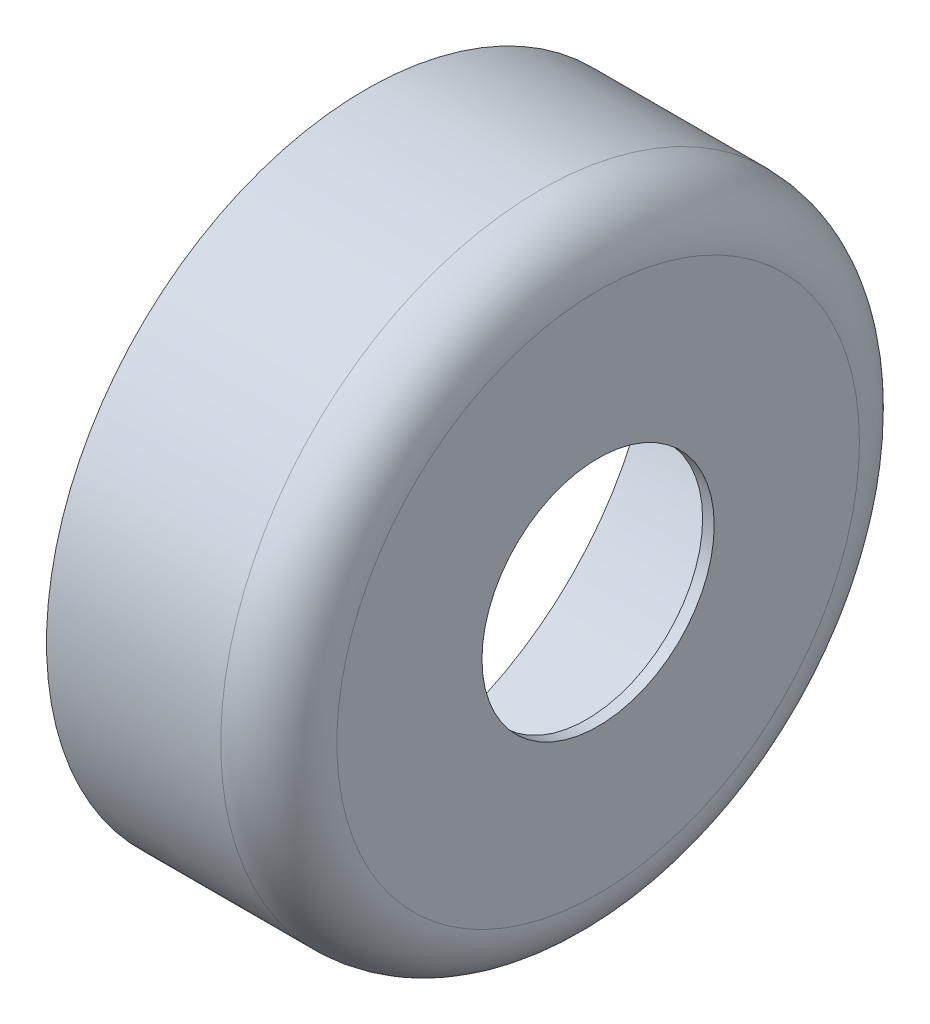
ISO-10303-21;
HEADER;
FILE_DESCRIPTION(('STEP AP214'),'2;1');
FILE_NAME('part.step','',(''),(''),'','','');
FILE_SCHEMA(('AUTOMOTIVE_DESIGN { 1 0 10303 214 1 1 1 1 }'));
ENDSEC;
DATA;
#1=APPLICATION_CONTEXT('core data for automotive mechanical design processes');
#2=APPLICATION_PROTOCOL_DEFINITION('international standard','automotive_design',2000,#1);
#3=PRODUCT_CONTEXT('',#1,'mechanical');
#4=PRODUCT('Part','Part','',(#3));
#5=PRODUCT_RELATED_PRODUCT_CATEGORY('part','',(#4));
#6=PRODUCT_DEFINITION_FORMATION('','',#4);
#7=PRODUCT_DEFINITION_CONTEXT('part definition',#1,'design');
#8=PRODUCT_DEFINITION('design','',#6,#7);
#9=PRODUCT_DEFINITION_SHAPE('','',#8);
#10=(LENGTH_UNIT() NAMED_UNIT(*) SI_UNIT(.MILLI.,.METRE.));
#11=(NAMED_UNIT(*) PLANE_ANGLE_UNIT() SI_UNIT($,.RADIAN.));
#12=(NAMED_UNIT(*) SI_UNIT($,.STERADIAN.) SOLID_ANGLE_UNIT());
#13=UNCERTAINTY_MEASURE_WITH_UNIT(LENGTH_MEASURE(1.E-05),#10,'distance_accuracy_value','');
#14=(GEOMETRIC_REPRESENTATION_CONTEXT(3) GLOBAL_UNCERTAINTY_ASSIGNED_CONTEXT((#13)) GLOBAL_UNIT_ASSIGNED_CONTEXT((#10,
#11,#12)) REPRESENTATION_CONTEXT('',''));
#15=CARTESIAN_POINT('',(0.,0.,0.));
#16=DIRECTION('',(0.,0.,1.));
#17=DIRECTION('',(1.,0.,0.));
#18=AXIS2_PLACEMENT_3D('',#15,#16,#17);
#19=CARTESIAN_POINT('',(40.,0.,0.));
#20=DIRECTION('',(-1.,0.,0.));
#21=DIRECTION('',(0.,0.,1.));
#22=AXIS2_PLACEMENT_3D('',#19,#20,#21);
#23=CYLINDRICAL_SURFACE('',#22,55.);
#24=CARTESIAN_POINT('',(30.,0.,0.));
#25=DIRECTION('',(1.,0.,0.));
#26=DIRECTION('',(0.,0.,-1.));
#27=AXIS2_PLACEMENT_3D('',#24,#25,#26);
#28=CIRCLE('',#27,55.);
#29=CARTESIAN_POINT('',(30.,0.,-55.));
#30=VERTEX_POINT('',#29);
#31=EDGE_CURVE('E10',#30,#30,#28,.F.);
#32=ORIENTED_EDGE('',*,*,#31,.T.);
#33=EDGE_LOOP('',(#32));
#34=FACE_BOUND('',#33,.T.);
#35=CARTESIAN_POINT('',(0.,0.,0.));
#36=DIRECTION('',(1.,0.,0.));
#37=DIRECTION('',(0.,0.,-1.));
#38=AXIS2_PLACEMENT_3D('',#35,#36,#37);
#39=CIRCLE('',#38,55.);
#40=CARTESIAN_POINT('',(0.,0.,-55.));
#41=VERTEX_POINT('',#40);
#42=EDGE_CURVE('E52',#41,#41,#39,.T.);
#43=ORIENTED_EDGE('',*,*,#42,.T.);
#44=EDGE_LOOP('',(#43));
#45=FACE_BOUND('',#44,.T.);
#46=ADVANCED_FACE('F38',(#34,#45),#23,.T.);
#47=CARTESIAN_POINT('',(40.,0.,0.));
#48=DIRECTION('',(1.,0.,0.));
#49=DIRECTION('',(0.,0.,-1.));
#50=AXIS2_PLACEMENT_3D('',#47,#48,#49);
#51=PLANE('',#50);
#52=CARTESIAN_POINT('',(40.,0.,0.));
#53=DIRECTION('',(1.,0.,0.));
#54=DIRECTION('',(0.,0.,-1.));
#55=AXIS2_PLACEMENT_3D('',#52,#53,#54);
#56=CIRCLE('',#55,45.);
#57=CARTESIAN_POINT('',(40.,0.,-45.));
#58=VERTEX_POINT('',#57);
#59=EDGE_CURVE('E46',#58,#58,#56,.T.);
#60=ORIENTED_EDGE('',*,*,#59,.T.);
#61=EDGE_LOOP('',(#60));
#62=FACE_BOUND('',#61,.T.);
#63=CARTESIAN_POINT('',(40.,0.,0.));
#64=DIRECTION('',(1.,0.,0.));
#65=DIRECTION('',(0.,0.,-1.));
#66=AXIS2_PLACEMENT_3D('',#63,#64,#65);
#67=CIRCLE('',#66,20.);
#68=CARTESIAN_POINT('',(40.,0.,-20.));
#69=VERTEX_POINT('',#68);
#70=EDGE_CURVE('E65',#69,#69,#67,.T.);
#71=ORIENTED_EDGE('',*,*,#70,.F.);
#72=EDGE_LOOP('',(#71));
#73=FACE_BOUND('',#72,.T.);
#74=ADVANCED_FACE('F77',(#62,#73),#51,.T.);
#75=CARTESIAN_POINT('',(0.,0.,0.));
#76=DIRECTION('',(1.,0.,0.));
#77=DIRECTION('',(0.,0.,-1.));
#78=AXIS2_PLACEMENT_3D('',#75,#76,#77);
#79=PLANE('',#78);
#80=CARTESIAN_POINT('',(0.,0.,0.));
#81=DIRECTION('',(-1.,0.,0.));
#82=DIRECTION('',(0.,0.,1.));
#83=AXIS2_PLACEMENT_3D('',#80,#81,#82);
#84=CIRCLE('',#83,50.);
#85=CARTESIAN_POINT('',(0.,0.,50.));
#86=VERTEX_POINT('',#85);
#87=EDGE_CURVE('E64',#86,#86,#84,.T.);
#88=ORIENTED_EDGE('',*,*,#87,.F.);
#89=EDGE_LOOP('',(#88));
#90=FACE_BOUND('',#89,.T.);
#91=ORIENTED_EDGE('',*,*,#42,.F.);
#92=EDGE_LOOP('',(#91));
#93=FACE_BOUND('',#92,.T.);
#94=ADVANCED_FACE('F79',(#90,#93),#79,.F.);
#95=CARTESIAN_POINT('',(38.,0.,0.));
#96=DIRECTION('',(-1.,0.,0.));
#97=DIRECTION('',(0.,0.,1.));
#98=AXIS2_PLACEMENT_3D('',#95,#96,#97);
#99=CYLINDRICAL_SURFACE('',#98,50.);
#100=CARTESIAN_POINT('',(38.,0.,0.));
#101=DIRECTION('',(-1.,0.,0.));
#102=DIRECTION('',(0.,0.,1.));
#103=AXIS2_PLACEMENT_3D('',#100,#101,#102);
#104=CIRCLE('',#103,50.);
#105=CARTESIAN_POINT('',(38.,0.,50.));
#106=VERTEX_POINT('',#105);
#107=EDGE_CURVE('E58',#106,#106,#104,.T.);
#108=ORIENTED_EDGE('',*,*,#107,.F.);
#109=EDGE_LOOP('',(#108));
#110=FACE_BOUND('',#109,.T.);
#111=ORIENTED_EDGE('',*,*,#87,.T.);
#112=EDGE_LOOP('',(#111));
#113=FACE_BOUND('',#112,.T.);
#114=ADVANCED_FACE('F85',(#110,#113),#99,.F.);
#115=CARTESIAN_POINT('',(38.,0.,0.));
#116=DIRECTION('',(-1.,0.,0.));
#117=DIRECTION('',(0.,0.,1.));
#118=AXIS2_PLACEMENT_3D('',#115,#116,#117);
#119=PLANE('',#118);
#120=CARTESIAN_POINT('',(38.,0.,0.));
#121=DIRECTION('',(-1.,0.,0.));
#122=DIRECTION('',(0.,0.,1.));
#123=AXIS2_PLACEMENT_3D('',#120,#121,#122);
#124=CIRCLE('',#123,20.);
#125=CARTESIAN_POINT('',(38.,0.,20.));
#126=VERTEX_POINT('',#125);
#127=EDGE_CURVE('E61',#126,#126,#124,.T.);
#128=ORIENTED_EDGE('',*,*,#127,.F.);
#129=EDGE_LOOP('',(#128));
#130=FACE_BOUND('',#129,.T.);
#131=ORIENTED_EDGE('',*,*,#107,.T.);
#132=EDGE_LOOP('',(#131));
#133=FACE_BOUND('',#132,.T.);
#134=ADVANCED_FACE('F91',(#130,#133),#119,.T.);
#135=CARTESIAN_POINT('',(2.,0.,0.));
#136=DIRECTION('',(1.,0.,0.));
#137=DIRECTION('',(0.,0.,-1.));
#138=AXIS2_PLACEMENT_3D('',#135,#136,#137);
#139=CYLINDRICAL_SURFACE('',#138,20.);
#140=ORIENTED_EDGE('',*,*,#127,.T.);
#141=EDGE_LOOP('',(#140));
#142=FACE_BOUND('',#141,.T.);
#143=ORIENTED_EDGE('',*,*,#70,.T.);
#144=EDGE_LOOP('',(#143));
#145=FACE_BOUND('',#144,.T.);
#146=ADVANCED_FACE('F75',(#142,#145),#139,.F.);
#147=CARTESIAN_POINT('',(30.,0.,0.));
#148=DIRECTION('',(1.,0.,0.));
#149=DIRECTION('',(0.,0.,-1.));
#150=AXIS2_PLACEMENT_3D('',#147,#148,#149);
#151=TOROIDAL_SURFACE('',#150,45.,10.);
#152=ORIENTED_EDGE('',*,*,#31,.F.);
#153=EDGE_LOOP('',(#152));
#154=FACE_BOUND('',#153,.T.);
#155=ORIENTED_EDGE('',*,*,#59,.F.);
#156=EDGE_LOOP('',(#155));
#157=FACE_BOUND('',#156,.T.);
#158=ADVANCED_FACE('F40',(#154,#157),#151,.T.);
#159=CLOSED_SHELL('',(#46,#74,#94,#114,#134,#146,#158));
#160=MANIFOLD_SOLID_BREP('B2',#159);
#161=ADVANCED_BREP_SHAPE_REPRESENTATION('',(#18,#160),#14);
#162=SHAPE_DEFINITION_REPRESENTATION(#9,#161);
ENDSEC;
END-ISO-10303-21;
